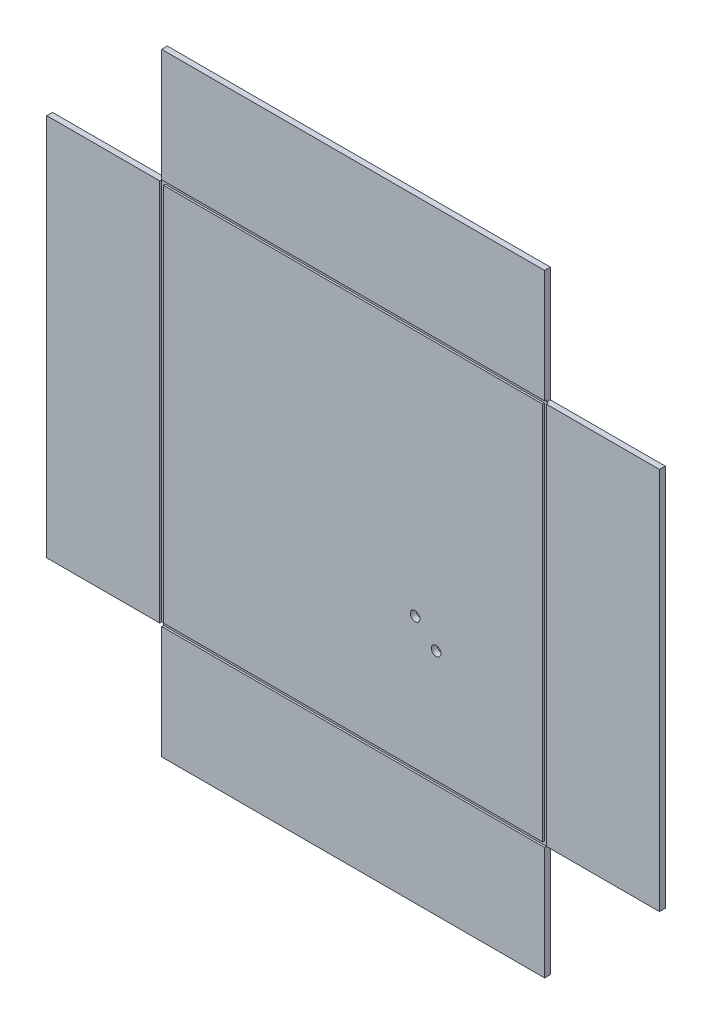
ISO-10303-21;
HEADER;
FILE_DESCRIPTION(('STEP AP214'),'2;1');
FILE_NAME('part.step','',(''),(''),'','','');
FILE_SCHEMA(('AUTOMOTIVE_DESIGN { 1 0 10303 214 1 1 1 1 }'));
ENDSEC;
DATA;
#1=APPLICATION_CONTEXT('core data for automotive mechanical design processes');
#2=APPLICATION_PROTOCOL_DEFINITION('international standard','automotive_design',2000,#1);
#3=PRODUCT_CONTEXT('',#1,'mechanical');
#4=PRODUCT('Part','Part','',(#3));
#5=PRODUCT_RELATED_PRODUCT_CATEGORY('part','',(#4));
#6=PRODUCT_DEFINITION_FORMATION('','',#4);
#7=PRODUCT_DEFINITION_CONTEXT('part definition',#1,'design');
#8=PRODUCT_DEFINITION('design','',#6,#7);
#9=PRODUCT_DEFINITION_SHAPE('','',#8);
#10=(LENGTH_UNIT() NAMED_UNIT(*) SI_UNIT(.MILLI.,.METRE.));
#11=(NAMED_UNIT(*) PLANE_ANGLE_UNIT() SI_UNIT($,.RADIAN.));
#12=(NAMED_UNIT(*) SI_UNIT($,.STERADIAN.) SOLID_ANGLE_UNIT());
#13=UNCERTAINTY_MEASURE_WITH_UNIT(LENGTH_MEASURE(1.E-05),#10,'distance_accuracy_value','');
#14=(GEOMETRIC_REPRESENTATION_CONTEXT(3) GLOBAL_UNCERTAINTY_ASSIGNED_CONTEXT((#13)) GLOBAL_UNIT_ASSIGNED_CONTEXT((#10,
#11,#12)) REPRESENTATION_CONTEXT('',''));
#15=CARTESIAN_POINT('',(0.,0.,0.));
#16=DIRECTION('',(0.,0.,1.));
#17=DIRECTION('',(1.,0.,0.));
#18=AXIS2_PLACEMENT_3D('',#15,#16,#17);
#19=CARTESIAN_POINT('',(0.,0.,3.));
#20=DIRECTION('',(0.,0.,1.));
#21=DIRECTION('',(1.,0.,0.));
#22=AXIS2_PLACEMENT_3D('',#19,#20,#21);
#23=PLANE('',#22);
#24=DIRECTION('',(0.,-1.,0.));
#25=VECTOR('',#24,1.);
#26=CARTESIAN_POINT('',(-101.000000000001,101.,3.));
#27=LINE('',#26,#25);
#28=CARTESIAN_POINT('',(-101.000000000001,100.,3.));
#29=VERTEX_POINT('',#28);
#30=CARTESIAN_POINT('',(-101.000000000001,-100.,3.));
#31=VERTEX_POINT('',#30);
#32=EDGE_CURVE('E235',#29,#31,#27,.T.);
#33=ORIENTED_EDGE('',*,*,#32,.F.);
#34=DIRECTION('',(1.,0.,0.));
#35=VECTOR('',#34,1.);
#36=CARTESIAN_POINT('',(-160.000000000001,100.,3.));
#37=LINE('',#36,#35);
#38=CARTESIAN_POINT('',(-160.000000000001,100.,3.));
#39=VERTEX_POINT('',#38);
#40=EDGE_CURVE('E321',#39,#29,#37,.T.);
#41=ORIENTED_EDGE('',*,*,#40,.F.);
#42=DIRECTION('',(0.,-1.,0.));
#43=VECTOR('',#42,1.);
#44=CARTESIAN_POINT('',(-160.,160.,3.));
#45=LINE('',#44,#43);
#46=CARTESIAN_POINT('',(-160.,-100.,3.));
#47=VERTEX_POINT('',#46);
#48=EDGE_CURVE('E352',#39,#47,#45,.T.);
#49=ORIENTED_EDGE('',*,*,#48,.T.);
#50=DIRECTION('',(-1.,0.,0.));
#51=VECTOR('',#50,1.);
#52=CARTESIAN_POINT('',(-160.,-100.,3.));
#53=LINE('',#52,#51);
#54=EDGE_CURVE('E341',#31,#47,#53,.T.);
#55=ORIENTED_EDGE('',*,*,#54,.F.);
#56=EDGE_LOOP('',(#33,#41,#49,#55));
#57=FACE_BOUND('',#56,.T.);
#58=ADVANCED_FACE('F33',(#57),#23,.T.);
#59=DIRECTION('',(-1.,0.,0.));
#60=VECTOR('',#59,1.);
#61=CARTESIAN_POINT('',(-101.000000000001,101.,3.));
#62=LINE('',#61,#60);
#63=CARTESIAN_POINT('',(99.9999999999991,101.,3.));
#64=VERTEX_POINT('',#63);
#65=CARTESIAN_POINT('',(-100.000000000001,101.,3.));
#66=VERTEX_POINT('',#65);
#67=EDGE_CURVE('E243',#64,#66,#62,.T.);
#68=ORIENTED_EDGE('',*,*,#67,.F.);
#69=DIRECTION('',(0.,-1.,0.));
#70=VECTOR('',#69,1.);
#71=CARTESIAN_POINT('',(99.9999999999991,100.,3.));
#72=LINE('',#71,#70);
#73=CARTESIAN_POINT('',(99.9999999999991,160.,3.));
#74=VERTEX_POINT('',#73);
#75=EDGE_CURVE('E304',#74,#64,#72,.T.);
#76=ORIENTED_EDGE('',*,*,#75,.F.);
#77=DIRECTION('',(-1.,0.,0.));
#78=VECTOR('',#77,1.);
#79=CARTESIAN_POINT('',(-160.,160.,3.));
#80=LINE('',#79,#78);
#81=CARTESIAN_POINT('',(-100.000000000001,160.,3.));
#82=VERTEX_POINT('',#81);
#83=EDGE_CURVE('E362',#74,#82,#80,.T.);
#84=ORIENTED_EDGE('',*,*,#83,.T.);
#85=DIRECTION('',(0.,1.,0.));
#86=VECTOR('',#85,1.);
#87=CARTESIAN_POINT('',(-100.000000000001,100.,3.));
#88=LINE('',#87,#86);
#89=EDGE_CURVE('E324',#66,#82,#88,.T.);
#90=ORIENTED_EDGE('',*,*,#89,.F.);
#91=EDGE_LOOP('',(#68,#76,#84,#90));
#92=FACE_BOUND('',#91,.T.);
#93=ADVANCED_FACE('F392',(#92),#23,.T.);
#94=DIRECTION('',(0.,1.,0.));
#95=VECTOR('',#94,1.);
#96=CARTESIAN_POINT('',(101.,101.,3.));
#97=LINE('',#96,#95);
#98=CARTESIAN_POINT('',(101.,-100.,3.));
#99=VERTEX_POINT('',#98);
#100=CARTESIAN_POINT('',(101.,100.,3.));
#101=VERTEX_POINT('',#100);
#102=EDGE_CURVE('E254',#99,#101,#97,.T.);
#103=ORIENTED_EDGE('',*,*,#102,.F.);
#104=DIRECTION('',(-1.,0.,0.));
#105=VECTOR('',#104,1.);
#106=CARTESIAN_POINT('',(100.,-100.,3.));
#107=LINE('',#106,#105);
#108=CARTESIAN_POINT('',(160.,-100.,3.));
#109=VERTEX_POINT('',#108);
#110=EDGE_CURVE('E290',#109,#99,#107,.T.);
#111=ORIENTED_EDGE('',*,*,#110,.F.);
#112=DIRECTION('',(0.,1.,0.));
#113=VECTOR('',#112,1.);
#114=CARTESIAN_POINT('',(160.,160.,3.));
#115=LINE('',#114,#113);
#116=CARTESIAN_POINT('',(159.999999999999,100.,3.));
#117=VERTEX_POINT('',#116);
#118=EDGE_CURVE('E359',#109,#117,#115,.T.);
#119=ORIENTED_EDGE('',*,*,#118,.T.);
#120=DIRECTION('',(1.,0.,0.));
#121=VECTOR('',#120,1.);
#122=CARTESIAN_POINT('',(99.9999999999991,100.,3.));
#123=LINE('',#122,#121);
#124=EDGE_CURVE('E308',#101,#117,#123,.T.);
#125=ORIENTED_EDGE('',*,*,#124,.F.);
#126=EDGE_LOOP('',(#103,#111,#119,#125));
#127=FACE_BOUND('',#126,.T.);
#128=ADVANCED_FACE('F460',(#127),#23,.T.);
#129=CARTESIAN_POINT('',(-160.,160.,3.));
#130=DIRECTION('',(1.,0.,0.));
#131=DIRECTION('',(0.,0.,-1.));
#132=AXIS2_PLACEMENT_3D('',#129,#130,#131);
#133=PLANE('',#132);
#134=ORIENTED_EDGE('',*,*,#48,.F.);
#135=DIRECTION('',(0.,0.,1.));
#136=VECTOR('',#135,1.);
#137=CARTESIAN_POINT('',(-160.000000000001,100.,-0.00100000000000013));
#138=LINE('',#137,#136);
#139=CARTESIAN_POINT('',(-160.,100.,0.));
#140=VERTEX_POINT('',#139);
#141=EDGE_CURVE('E326',#140,#39,#138,.T.);
#142=ORIENTED_EDGE('',*,*,#141,.F.);
#143=DIRECTION('',(0.,-1.,0.));
#144=VECTOR('',#143,1.);
#145=CARTESIAN_POINT('',(-160.,160.,0.));
#146=LINE('',#145,#144);
#147=CARTESIAN_POINT('',(-160.,-100.,0.));
#148=VERTEX_POINT('',#147);
#149=EDGE_CURVE('E347',#140,#148,#146,.T.);
#150=ORIENTED_EDGE('',*,*,#149,.T.);
#151=DIRECTION('',(0.,0.,1.));
#152=VECTOR('',#151,1.);
#153=CARTESIAN_POINT('',(-160.,-100.,-0.00100000000000013));
#154=LINE('',#153,#152);
#155=EDGE_CURVE('E344',#148,#47,#154,.T.);
#156=ORIENTED_EDGE('',*,*,#155,.T.);
#157=EDGE_LOOP('',(#134,#142,#150,#156));
#158=FACE_BOUND('',#157,.T.);
#159=ADVANCED_FACE('F35',(#158),#133,.F.);
#160=CARTESIAN_POINT('',(-160.,-160.,3.));
#161=DIRECTION('',(0.,1.,0.));
#162=DIRECTION('',(-1.,0.,0.));
#163=AXIS2_PLACEMENT_3D('',#160,#161,#162);
#164=PLANE('',#163);
#165=DIRECTION('',(1.,0.,0.));
#166=VECTOR('',#165,1.);
#167=CARTESIAN_POINT('',(-160.,-160.,0.));
#168=LINE('',#167,#166);
#169=CARTESIAN_POINT('',(-100.,-160.,0.));
#170=VERTEX_POINT('',#169);
#171=CARTESIAN_POINT('',(100.,-160.,0.));
#172=VERTEX_POINT('',#171);
#173=EDGE_CURVE('E367',#170,#172,#168,.T.);
#174=ORIENTED_EDGE('',*,*,#173,.T.);
#175=DIRECTION('',(0.,0.,1.));
#176=VECTOR('',#175,1.);
#177=CARTESIAN_POINT('',(100.,-160.,-0.00100000000000013));
#178=LINE('',#177,#176);
#179=CARTESIAN_POINT('',(100.,-160.,3.));
#180=VERTEX_POINT('',#179);
#181=EDGE_CURVE('E293',#172,#180,#178,.T.);
#182=ORIENTED_EDGE('',*,*,#181,.T.);
#183=DIRECTION('',(1.,0.,0.));
#184=VECTOR('',#183,1.);
#185=CARTESIAN_POINT('',(-160.,-160.,3.));
#186=LINE('',#185,#184);
#187=CARTESIAN_POINT('',(-100.,-160.,3.));
#188=VERTEX_POINT('',#187);
#189=EDGE_CURVE('E355',#188,#180,#186,.T.);
#190=ORIENTED_EDGE('',*,*,#189,.F.);
#191=DIRECTION('',(0.,0.,1.));
#192=VECTOR('',#191,1.);
#193=CARTESIAN_POINT('',(-100.,-160.,-0.00100000000000013));
#194=LINE('',#193,#192);
#195=EDGE_CURVE('E343',#170,#188,#194,.T.);
#196=ORIENTED_EDGE('',*,*,#195,.F.);
#197=EDGE_LOOP('',(#174,#182,#190,#196));
#198=FACE_BOUND('',#197,.T.);
#199=ADVANCED_FACE('F439',(#198),#164,.F.);
#200=CARTESIAN_POINT('',(160.,160.,3.));
#201=DIRECTION('',(-1.,0.,0.));
#202=DIRECTION('',(0.,-1.,0.));
#203=AXIS2_PLACEMENT_3D('',#200,#201,#202);
#204=PLANE('',#203);
#205=ORIENTED_EDGE('',*,*,#118,.F.);
#206=DIRECTION('',(0.,0.,1.));
#207=VECTOR('',#206,1.);
#208=CARTESIAN_POINT('',(160.,-100.,-0.00100000000000013));
#209=LINE('',#208,#207);
#210=CARTESIAN_POINT('',(160.,-100.,0.));
#211=VERTEX_POINT('',#210);
#212=EDGE_CURVE('E298',#211,#109,#209,.T.);
#213=ORIENTED_EDGE('',*,*,#212,.F.);
#214=DIRECTION('',(0.,1.,0.));
#215=VECTOR('',#214,1.);
#216=CARTESIAN_POINT('',(160.,160.,0.));
#217=LINE('',#216,#215);
#218=CARTESIAN_POINT('',(160.,100.,0.));
#219=VERTEX_POINT('',#218);
#220=EDGE_CURVE('E370',#211,#219,#217,.T.);
#221=ORIENTED_EDGE('',*,*,#220,.T.);
#222=DIRECTION('',(0.,0.,1.));
#223=VECTOR('',#222,1.);
#224=CARTESIAN_POINT('',(159.999999999999,100.,-0.00100000000000013));
#225=LINE('',#224,#223);
#226=EDGE_CURVE('E313',#219,#117,#225,.T.);
#227=ORIENTED_EDGE('',*,*,#226,.T.);
#228=EDGE_LOOP('',(#205,#213,#221,#227));
#229=FACE_BOUND('',#228,.T.);
#230=ADVANCED_FACE('F456',(#229),#204,.F.);
#231=CARTESIAN_POINT('',(-160.,160.,3.));
#232=DIRECTION('',(0.,-1.,0.));
#233=DIRECTION('',(0.,0.,-1.));
#234=AXIS2_PLACEMENT_3D('',#231,#232,#233);
#235=PLANE('',#234);
#236=ORIENTED_EDGE('',*,*,#83,.F.);
#237=DIRECTION('',(0.,0.,1.));
#238=VECTOR('',#237,1.);
#239=CARTESIAN_POINT('',(99.9999999999991,160.,-0.00100000000000013));
#240=LINE('',#239,#238);
#241=CARTESIAN_POINT('',(99.9999999999991,160.,0.));
#242=VERTEX_POINT('',#241);
#243=EDGE_CURVE('E311',#242,#74,#240,.T.);
#244=ORIENTED_EDGE('',*,*,#243,.F.);
#245=DIRECTION('',(-1.,0.,0.));
#246=VECTOR('',#245,1.);
#247=CARTESIAN_POINT('',(-160.,160.,0.));
#248=LINE('',#247,#246);
#249=CARTESIAN_POINT('',(-100.000000000001,160.,0.));
#250=VERTEX_POINT('',#249);
#251=EDGE_CURVE('E356',#242,#250,#248,.T.);
#252=ORIENTED_EDGE('',*,*,#251,.T.);
#253=DIRECTION('',(0.,0.,1.));
#254=VECTOR('',#253,1.);
#255=CARTESIAN_POINT('',(-100.000000000001,160.,-0.00100000000000013));
#256=LINE('',#255,#254);
#257=EDGE_CURVE('E327',#250,#82,#256,.T.);
#258=ORIENTED_EDGE('',*,*,#257,.T.);
#259=EDGE_LOOP('',(#236,#244,#252,#258));
#260=FACE_BOUND('',#259,.T.);
#261=ADVANCED_FACE('F399',(#260),#235,.F.);
#262=DIRECTION('',(1.,0.,0.));
#263=VECTOR('',#262,1.);
#264=CARTESIAN_POINT('',(-101.000000000001,-101.,3.));
#265=LINE('',#264,#263);
#266=CARTESIAN_POINT('',(-100.,-101.,3.));
#267=VERTEX_POINT('',#266);
#268=CARTESIAN_POINT('',(100.,-101.,3.));
#269=VERTEX_POINT('',#268);
#270=EDGE_CURVE('E252',#267,#269,#265,.T.);
#271=ORIENTED_EDGE('',*,*,#270,.F.);
#272=DIRECTION('',(0.,1.,0.));
#273=VECTOR('',#272,1.);
#274=CARTESIAN_POINT('',(-100.,-160.,3.));
#275=LINE('',#274,#273);
#276=EDGE_CURVE('E338',#188,#267,#275,.T.);
#277=ORIENTED_EDGE('',*,*,#276,.F.);
#278=ORIENTED_EDGE('',*,*,#189,.T.);
#279=DIRECTION('',(0.,-1.,0.));
#280=VECTOR('',#279,1.);
#281=CARTESIAN_POINT('',(100.,-160.,3.));
#282=LINE('',#281,#280);
#283=EDGE_CURVE('E288',#269,#180,#282,.T.);
#284=ORIENTED_EDGE('',*,*,#283,.F.);
#285=EDGE_LOOP('',(#271,#277,#278,#284));
#286=FACE_BOUND('',#285,.T.);
#287=ADVANCED_FACE('F443',(#286),#23,.T.);
#288=CARTESIAN_POINT('',(0.,0.,0.));
#289=DIRECTION('',(0.,0.,1.));
#290=DIRECTION('',(1.,0.,0.));
#291=AXIS2_PLACEMENT_3D('',#288,#289,#290);
#292=PLANE('',#291);
#293=CARTESIAN_POINT('',(32.3499682837209,-30.1668334606443,0.));
#294=DIRECTION('',(0.,0.,1.));
#295=DIRECTION('',(1.,0.,0.));
#296=AXIS2_PLACEMENT_3D('',#293,#294,#295);
#297=CIRCLE('',#296,2.5);
#298=CARTESIAN_POINT('',(34.8499682837209,-30.1668334606443,0.));
#299=VERTEX_POINT('',#298);
#300=EDGE_CURVE('E699',#299,#299,#297,.T.);
#301=ORIENTED_EDGE('',*,*,#300,.T.);
#302=EDGE_LOOP('',(#301));
#303=FACE_BOUND('',#302,.T.);
#304=CARTESIAN_POINT('',(43.3202738080086,-40.3968088615817,0.));
#305=DIRECTION('',(0.,0.,1.));
#306=DIRECTION('',(1.,0.,0.));
#307=AXIS2_PLACEMENT_3D('',#304,#305,#306);
#308=CIRCLE('',#307,2.5);
#309=CARTESIAN_POINT('',(45.8202738080085,-40.3968088615817,0.));
#310=VERTEX_POINT('',#309);
#311=EDGE_CURVE('E225',#310,#310,#308,.T.);
#312=ORIENTED_EDGE('',*,*,#311,.T.);
#313=EDGE_LOOP('',(#312));
#314=FACE_BOUND('',#313,.T.);
#315=DIRECTION('',(1.,0.,0.));
#316=VECTOR('',#315,1.);
#317=CARTESIAN_POINT('',(100.,-100.,0.));
#318=LINE('',#317,#316);
#319=CARTESIAN_POINT('',(100.,-100.,0.));
#320=VERTEX_POINT('',#319);
#321=EDGE_CURVE('E283',#320,#211,#318,.T.);
#322=ORIENTED_EDGE('',*,*,#321,.F.);
#323=DIRECTION('',(0.,1.,0.));
#324=VECTOR('',#323,1.);
#325=CARTESIAN_POINT('',(100.,-160.,0.));
#326=LINE('',#325,#324);
#327=EDGE_CURVE('E285',#172,#320,#326,.T.);
#328=ORIENTED_EDGE('',*,*,#327,.F.);
#329=ORIENTED_EDGE('',*,*,#173,.F.);
#330=DIRECTION('',(0.,-1.,0.));
#331=VECTOR('',#330,1.);
#332=CARTESIAN_POINT('',(-100.,-160.,0.));
#333=LINE('',#332,#331);
#334=CARTESIAN_POINT('',(-100.,-100.,0.));
#335=VERTEX_POINT('',#334);
#336=EDGE_CURVE('E297',#335,#170,#333,.T.);
#337=ORIENTED_EDGE('',*,*,#336,.F.);
#338=DIRECTION('',(1.,0.,0.));
#339=VECTOR('',#338,1.);
#340=CARTESIAN_POINT('',(-160.,-100.,0.));
#341=LINE('',#340,#339);
#342=EDGE_CURVE('E336',#148,#335,#341,.T.);
#343=ORIENTED_EDGE('',*,*,#342,.F.);
#344=ORIENTED_EDGE('',*,*,#149,.F.);
#345=DIRECTION('',(-1.,0.,0.));
#346=VECTOR('',#345,1.);
#347=CARTESIAN_POINT('',(-160.000000000001,100.,0.));
#348=LINE('',#347,#346);
#349=CARTESIAN_POINT('',(-100.000000000001,100.,0.));
#350=VERTEX_POINT('',#349);
#351=EDGE_CURVE('E305',#350,#140,#348,.T.);
#352=ORIENTED_EDGE('',*,*,#351,.F.);
#353=DIRECTION('',(0.,-1.,0.));
#354=VECTOR('',#353,1.);
#355=CARTESIAN_POINT('',(-100.000000000001,100.,0.));
#356=LINE('',#355,#354);
#357=EDGE_CURVE('E282',#250,#350,#356,.T.);
#358=ORIENTED_EDGE('',*,*,#357,.F.);
#359=ORIENTED_EDGE('',*,*,#251,.F.);
#360=DIRECTION('',(0.,1.,0.));
#361=VECTOR('',#360,1.);
#362=CARTESIAN_POINT('',(99.9999999999991,100.,0.));
#363=LINE('',#362,#361);
#364=CARTESIAN_POINT('',(99.9999999999991,100.,0.));
#365=VERTEX_POINT('',#364);
#366=EDGE_CURVE('E302',#365,#242,#363,.T.);
#367=ORIENTED_EDGE('',*,*,#366,.F.);
#368=DIRECTION('',(-1.,0.,0.));
#369=VECTOR('',#368,1.);
#370=CARTESIAN_POINT('',(99.9999999999991,100.,0.));
#371=LINE('',#370,#369);
#372=EDGE_CURVE('E286',#219,#365,#371,.T.);
#373=ORIENTED_EDGE('',*,*,#372,.F.);
#374=ORIENTED_EDGE('',*,*,#220,.F.);
#375=EDGE_LOOP('',(#322,#328,#329,#337,#343,#344,#352,#358,#359,#367,#373,#374));
#376=FACE_BOUND('',#375,.T.);
#377=ADVANCED_FACE('F405',(#303,#314,#376),#292,.F.);
#378=CARTESIAN_POINT('',(-160.,-100.,-0.00100000000000013));
#379=DIRECTION('',(0.,1.,0.));
#380=DIRECTION('',(0.,0.,1.));
#381=AXIS2_PLACEMENT_3D('',#378,#379,#380);
#382=PLANE('',#381);
#383=DIRECTION('',(1.,0.,0.));
#384=VECTOR('',#383,1.);
#385=CARTESIAN_POINT('',(-160.,-100.,2.));
#386=LINE('',#385,#384);
#387=CARTESIAN_POINT('',(-101.000000000001,-100.,2.));
#388=VERTEX_POINT('',#387);
#389=CARTESIAN_POINT('',(-100.,-100.,2.));
#390=VERTEX_POINT('',#389);
#391=EDGE_CURVE('E268',#388,#390,#386,.T.);
#392=ORIENTED_EDGE('',*,*,#391,.F.);
#393=DIRECTION('',(0.,0.,1.));
#394=VECTOR('',#393,1.);
#395=CARTESIAN_POINT('',(-101.000000000001,-100.,-0.00100000000000013));
#396=LINE('',#395,#394);
#397=EDGE_CURVE('E279',#388,#31,#396,.T.);
#398=ORIENTED_EDGE('',*,*,#397,.T.);
#399=ORIENTED_EDGE('',*,*,#54,.T.);
#400=ORIENTED_EDGE('',*,*,#155,.F.);
#401=ORIENTED_EDGE('',*,*,#342,.T.);
#402=DIRECTION('',(0.,0.,1.));
#403=VECTOR('',#402,1.);
#404=CARTESIAN_POINT('',(-100.,-100.,-0.00100000000000013));
#405=LINE('',#404,#403);
#406=EDGE_CURVE('E348',#335,#390,#405,.T.);
#407=ORIENTED_EDGE('',*,*,#406,.T.);
#408=EDGE_LOOP('',(#392,#398,#399,#400,#401,#407));
#409=FACE_BOUND('',#408,.T.);
#410=ADVANCED_FACE('F421',(#409),#382,.F.);
#411=CARTESIAN_POINT('',(-100.,-160.,-0.00100000000000013));
#412=DIRECTION('',(1.,0.,0.));
#413=DIRECTION('',(0.,0.,-1.));
#414=AXIS2_PLACEMENT_3D('',#411,#412,#413);
#415=PLANE('',#414);
#416=ORIENTED_EDGE('',*,*,#276,.T.);
#417=DIRECTION('',(0.,0.,-1.));
#418=VECTOR('',#417,1.);
#419=CARTESIAN_POINT('',(-100.,-101.,-0.00100000000000013));
#420=LINE('',#419,#418);
#421=CARTESIAN_POINT('',(-100.,-101.,2.));
#422=VERTEX_POINT('',#421);
#423=EDGE_CURVE('E273',#267,#422,#420,.T.);
#424=ORIENTED_EDGE('',*,*,#423,.T.);
#425=DIRECTION('',(0.,-1.,0.));
#426=VECTOR('',#425,1.);
#427=CARTESIAN_POINT('',(-100.,-160.,2.));
#428=LINE('',#427,#426);
#429=EDGE_CURVE('E266',#390,#422,#428,.T.);
#430=ORIENTED_EDGE('',*,*,#429,.F.);
#431=ORIENTED_EDGE('',*,*,#406,.F.);
#432=ORIENTED_EDGE('',*,*,#336,.T.);
#433=ORIENTED_EDGE('',*,*,#195,.T.);
#434=EDGE_LOOP('',(#416,#424,#430,#431,#432,#433));
#435=FACE_BOUND('',#434,.T.);
#436=ADVANCED_FACE('F434',(#435),#415,.F.);
#437=CARTESIAN_POINT('',(-100.000000000001,100.,-0.00100000000000013));
#438=DIRECTION('',(1.,0.,0.));
#439=DIRECTION('',(0.,0.,-1.));
#440=AXIS2_PLACEMENT_3D('',#437,#438,#439);
#441=PLANE('',#440);
#442=DIRECTION('',(0.,-1.,0.));
#443=VECTOR('',#442,1.);
#444=CARTESIAN_POINT('',(-100.000000000001,100.,2.));
#445=LINE('',#444,#443);
#446=CARTESIAN_POINT('',(-100.000000000001,101.,2.));
#447=VERTEX_POINT('',#446);
#448=CARTESIAN_POINT('',(-100.000000000001,100.,2.));
#449=VERTEX_POINT('',#448);
#450=EDGE_CURVE('E264',#447,#449,#445,.T.);
#451=ORIENTED_EDGE('',*,*,#450,.F.);
#452=DIRECTION('',(0.,0.,1.));
#453=VECTOR('',#452,1.);
#454=CARTESIAN_POINT('',(-100.000000000001,101.,-0.00100000000000013));
#455=LINE('',#454,#453);
#456=EDGE_CURVE('E276',#447,#66,#455,.T.);
#457=ORIENTED_EDGE('',*,*,#456,.T.);
#458=ORIENTED_EDGE('',*,*,#89,.T.);
#459=ORIENTED_EDGE('',*,*,#257,.F.);
#460=ORIENTED_EDGE('',*,*,#357,.T.);
#461=DIRECTION('',(0.,0.,1.));
#462=VECTOR('',#461,1.);
#463=CARTESIAN_POINT('',(-100.000000000001,100.,-0.00100000000000013));
#464=LINE('',#463,#462);
#465=EDGE_CURVE('E330',#350,#449,#464,.T.);
#466=ORIENTED_EDGE('',*,*,#465,.T.);
#467=EDGE_LOOP('',(#451,#457,#458,#459,#460,#466));
#468=FACE_BOUND('',#467,.T.);
#469=ADVANCED_FACE('F396',(#468),#441,.F.);
#470=CARTESIAN_POINT('',(-160.000000000001,100.,-0.00100000000000013));
#471=DIRECTION('',(0.,-1.,0.));
#472=DIRECTION('',(0.,0.,-1.));
#473=AXIS2_PLACEMENT_3D('',#470,#471,#472);
#474=PLANE('',#473);
#475=ORIENTED_EDGE('',*,*,#40,.T.);
#476=DIRECTION('',(0.,0.,-1.));
#477=VECTOR('',#476,1.);
#478=CARTESIAN_POINT('',(-101.000000000001,100.,-0.00100000000000013));
#479=LINE('',#478,#477);
#480=CARTESIAN_POINT('',(-101.000000000001,100.,2.));
#481=VERTEX_POINT('',#480);
#482=EDGE_CURVE('E11',#29,#481,#479,.T.);
#483=ORIENTED_EDGE('',*,*,#482,.T.);
#484=DIRECTION('',(-1.,0.,0.));
#485=VECTOR('',#484,1.);
#486=CARTESIAN_POINT('',(-160.000000000001,100.,2.));
#487=LINE('',#486,#485);
#488=EDGE_CURVE('E262',#449,#481,#487,.T.);
#489=ORIENTED_EDGE('',*,*,#488,.F.);
#490=ORIENTED_EDGE('',*,*,#465,.F.);
#491=ORIENTED_EDGE('',*,*,#351,.T.);
#492=ORIENTED_EDGE('',*,*,#141,.T.);
#493=EDGE_LOOP('',(#475,#483,#489,#490,#491,#492));
#494=FACE_BOUND('',#493,.T.);
#495=ADVANCED_FACE('F412',(#494),#474,.F.);
#496=CARTESIAN_POINT('',(99.9999999999991,100.,-0.00100000000000013));
#497=DIRECTION('',(-1.,0.,0.));
#498=DIRECTION('',(0.,0.,1.));
#499=AXIS2_PLACEMENT_3D('',#496,#497,#498);
#500=PLANE('',#499);
#501=ORIENTED_EDGE('',*,*,#75,.T.);
#502=DIRECTION('',(0.,0.,-1.));
#503=VECTOR('',#502,1.);
#504=CARTESIAN_POINT('',(99.9999999999991,101.,-0.00100000000000013));
#505=LINE('',#504,#503);
#506=CARTESIAN_POINT('',(99.9999999999991,101.,2.));
#507=VERTEX_POINT('',#506);
#508=EDGE_CURVE('E41',#64,#507,#505,.T.);
#509=ORIENTED_EDGE('',*,*,#508,.T.);
#510=DIRECTION('',(0.,1.,0.));
#511=VECTOR('',#510,1.);
#512=CARTESIAN_POINT('',(99.9999999999991,100.,2.));
#513=LINE('',#512,#511);
#514=CARTESIAN_POINT('',(99.9999999999991,100.,2.));
#515=VERTEX_POINT('',#514);
#516=EDGE_CURVE('E260',#515,#507,#513,.T.);
#517=ORIENTED_EDGE('',*,*,#516,.F.);
#518=DIRECTION('',(0.,0.,1.));
#519=VECTOR('',#518,1.);
#520=CARTESIAN_POINT('',(99.9999999999991,100.,-0.00100000000000013));
#521=LINE('',#520,#519);
#522=EDGE_CURVE('E310',#365,#515,#521,.T.);
#523=ORIENTED_EDGE('',*,*,#522,.F.);
#524=ORIENTED_EDGE('',*,*,#366,.T.);
#525=ORIENTED_EDGE('',*,*,#243,.T.);
#526=EDGE_LOOP('',(#501,#509,#517,#523,#524,#525));
#527=FACE_BOUND('',#526,.T.);
#528=ADVANCED_FACE('F384',(#527),#500,.F.);
#529=CARTESIAN_POINT('',(99.9999999999991,100.,-0.00100000000000013));
#530=DIRECTION('',(0.,-1.,0.));
#531=DIRECTION('',(0.,0.,-1.));
#532=AXIS2_PLACEMENT_3D('',#529,#530,#531);
#533=PLANE('',#532);
#534=DIRECTION('',(-1.,0.,0.));
#535=VECTOR('',#534,1.);
#536=CARTESIAN_POINT('',(99.9999999999991,100.,2.));
#537=LINE('',#536,#535);
#538=CARTESIAN_POINT('',(101.,100.,2.));
#539=VERTEX_POINT('',#538);
#540=EDGE_CURVE('E258',#539,#515,#537,.T.);
#541=ORIENTED_EDGE('',*,*,#540,.F.);
#542=DIRECTION('',(0.,0.,1.));
#543=VECTOR('',#542,1.);
#544=CARTESIAN_POINT('',(101.,100.,-0.00100000000000013));
#545=LINE('',#544,#543);
#546=EDGE_CURVE('E270',#539,#101,#545,.T.);
#547=ORIENTED_EDGE('',*,*,#546,.T.);
#548=ORIENTED_EDGE('',*,*,#124,.T.);
#549=ORIENTED_EDGE('',*,*,#226,.F.);
#550=ORIENTED_EDGE('',*,*,#372,.T.);
#551=ORIENTED_EDGE('',*,*,#522,.T.);
#552=EDGE_LOOP('',(#541,#547,#548,#549,#550,#551));
#553=FACE_BOUND('',#552,.T.);
#554=ADVANCED_FACE('F467',(#553),#533,.F.);
#555=CARTESIAN_POINT('',(100.,-160.,-0.00100000000000013));
#556=DIRECTION('',(-1.,0.,0.));
#557=DIRECTION('',(0.,0.,1.));
#558=AXIS2_PLACEMENT_3D('',#555,#556,#557);
#559=PLANE('',#558);
#560=DIRECTION('',(0.,1.,0.));
#561=VECTOR('',#560,1.);
#562=CARTESIAN_POINT('',(100.,-160.,2.));
#563=LINE('',#562,#561);
#564=CARTESIAN_POINT('',(100.,-101.,2.));
#565=VERTEX_POINT('',#564);
#566=CARTESIAN_POINT('',(100.,-100.,2.));
#567=VERTEX_POINT('',#566);
#568=EDGE_CURVE('E56',#565,#567,#563,.T.);
#569=ORIENTED_EDGE('',*,*,#568,.F.);
#570=DIRECTION('',(0.,0.,1.));
#571=VECTOR('',#570,1.);
#572=CARTESIAN_POINT('',(100.,-101.,-0.00100000000000013));
#573=LINE('',#572,#571);
#574=EDGE_CURVE('E379',#565,#269,#573,.T.);
#575=ORIENTED_EDGE('',*,*,#574,.T.);
#576=ORIENTED_EDGE('',*,*,#283,.T.);
#577=ORIENTED_EDGE('',*,*,#181,.F.);
#578=ORIENTED_EDGE('',*,*,#327,.T.);
#579=DIRECTION('',(0.,0.,1.));
#580=VECTOR('',#579,1.);
#581=CARTESIAN_POINT('',(100.,-100.,-0.00100000000000013));
#582=LINE('',#581,#580);
#583=EDGE_CURVE('E294',#320,#567,#582,.T.);
#584=ORIENTED_EDGE('',*,*,#583,.T.);
#585=EDGE_LOOP('',(#569,#575,#576,#577,#578,#584));
#586=FACE_BOUND('',#585,.T.);
#587=ADVANCED_FACE('F448',(#586),#559,.F.);
#588=CARTESIAN_POINT('',(100.,-100.,-0.00100000000000013));
#589=DIRECTION('',(0.,1.,0.));
#590=DIRECTION('',(0.,0.,1.));
#591=AXIS2_PLACEMENT_3D('',#588,#589,#590);
#592=PLANE('',#591);
#593=ORIENTED_EDGE('',*,*,#110,.T.);
#594=DIRECTION('',(0.,0.,-1.));
#595=VECTOR('',#594,1.);
#596=CARTESIAN_POINT('',(101.,-100.,-0.00100000000000013));
#597=LINE('',#596,#595);
#598=CARTESIAN_POINT('',(101.,-100.,2.));
#599=VERTEX_POINT('',#598);
#600=EDGE_CURVE('E376',#99,#599,#597,.T.);
#601=ORIENTED_EDGE('',*,*,#600,.T.);
#602=DIRECTION('',(1.,0.,0.));
#603=VECTOR('',#602,1.);
#604=CARTESIAN_POINT('',(100.,-100.,2.));
#605=LINE('',#604,#603);
#606=EDGE_CURVE('E365',#567,#599,#605,.T.);
#607=ORIENTED_EDGE('',*,*,#606,.F.);
#608=ORIENTED_EDGE('',*,*,#583,.F.);
#609=ORIENTED_EDGE('',*,*,#321,.T.);
#610=ORIENTED_EDGE('',*,*,#212,.T.);
#611=EDGE_LOOP('',(#593,#601,#607,#608,#609,#610));
#612=FACE_BOUND('',#611,.T.);
#613=ADVANCED_FACE('F451',(#612),#592,.F.);
#614=CARTESIAN_POINT('',(-101.000000000001,101.,2.));
#615=DIRECTION('',(-1.,0.,0.));
#616=DIRECTION('',(0.,0.,1.));
#617=AXIS2_PLACEMENT_3D('',#614,#615,#616);
#618=PLANE('',#617);
#619=DIRECTION('',(0.,-1.,0.));
#620=VECTOR('',#619,1.);
#621=CARTESIAN_POINT('',(-101.000000000001,101.,2.));
#622=LINE('',#621,#620);
#623=EDGE_CURVE('E239',#481,#388,#622,.T.);
#624=ORIENTED_EDGE('',*,*,#623,.F.);
#625=ORIENTED_EDGE('',*,*,#482,.F.);
#626=ORIENTED_EDGE('',*,*,#32,.T.);
#627=ORIENTED_EDGE('',*,*,#397,.F.);
#628=EDGE_LOOP('',(#624,#625,#626,#627));
#629=FACE_BOUND('',#628,.T.);
#630=ADVANCED_FACE('F417',(#629),#618,.F.);
#631=CARTESIAN_POINT('',(-101.000000000001,101.,2.));
#632=DIRECTION('',(0.,1.,0.));
#633=DIRECTION('',(0.,0.,1.));
#634=AXIS2_PLACEMENT_3D('',#631,#632,#633);
#635=PLANE('',#634);
#636=DIRECTION('',(-1.,0.,0.));
#637=VECTOR('',#636,1.);
#638=CARTESIAN_POINT('',(-101.000000000001,101.,2.));
#639=LINE('',#638,#637);
#640=EDGE_CURVE('E248',#507,#447,#639,.T.);
#641=ORIENTED_EDGE('',*,*,#640,.F.);
#642=ORIENTED_EDGE('',*,*,#508,.F.);
#643=ORIENTED_EDGE('',*,*,#67,.T.);
#644=ORIENTED_EDGE('',*,*,#456,.F.);
#645=EDGE_LOOP('',(#641,#642,#643,#644));
#646=FACE_BOUND('',#645,.T.);
#647=ADVANCED_FACE('F389',(#646),#635,.F.);
#648=CARTESIAN_POINT('',(-101.000000000001,-101.,2.));
#649=DIRECTION('',(0.,-1.,0.));
#650=DIRECTION('',(0.,0.,-1.));
#651=AXIS2_PLACEMENT_3D('',#648,#649,#650);
#652=PLANE('',#651);
#653=ORIENTED_EDGE('',*,*,#270,.T.);
#654=ORIENTED_EDGE('',*,*,#574,.F.);
#655=DIRECTION('',(1.,0.,0.));
#656=VECTOR('',#655,1.);
#657=CARTESIAN_POINT('',(-101.000000000001,-101.,2.));
#658=LINE('',#657,#656);
#659=EDGE_CURVE('E242',#422,#565,#658,.T.);
#660=ORIENTED_EDGE('',*,*,#659,.F.);
#661=ORIENTED_EDGE('',*,*,#423,.F.);
#662=EDGE_LOOP('',(#653,#654,#660,#661));
#663=FACE_BOUND('',#662,.T.);
#664=ADVANCED_FACE('F446',(#663),#652,.F.);
#665=CARTESIAN_POINT('',(101.,101.,2.));
#666=DIRECTION('',(1.,0.,0.));
#667=DIRECTION('',(0.,1.,0.));
#668=AXIS2_PLACEMENT_3D('',#665,#666,#667);
#669=PLANE('',#668);
#670=DIRECTION('',(0.,1.,0.));
#671=VECTOR('',#670,1.);
#672=CARTESIAN_POINT('',(101.,101.,2.));
#673=LINE('',#672,#671);
#674=EDGE_CURVE('E245',#599,#539,#673,.T.);
#675=ORIENTED_EDGE('',*,*,#674,.F.);
#676=ORIENTED_EDGE('',*,*,#600,.F.);
#677=ORIENTED_EDGE('',*,*,#102,.T.);
#678=ORIENTED_EDGE('',*,*,#546,.F.);
#679=EDGE_LOOP('',(#675,#676,#677,#678));
#680=FACE_BOUND('',#679,.T.);
#681=ADVANCED_FACE('F464',(#680),#669,.F.);
#682=CARTESIAN_POINT('',(0.,0.,2.));
#683=DIRECTION('',(0.,0.,1.));
#684=DIRECTION('',(1.,0.,0.));
#685=AXIS2_PLACEMENT_3D('',#682,#683,#684);
#686=PLANE('',#685);
#687=DIRECTION('',(-1.,0.,0.));
#688=VECTOR('',#687,1.);
#689=CARTESIAN_POINT('',(-99.0000000000009,99.,2.));
#690=LINE('',#689,#688);
#691=CARTESIAN_POINT('',(99.,99.,2.));
#692=VERTEX_POINT('',#691);
#693=CARTESIAN_POINT('',(-99.0000000000009,99.,2.));
#694=VERTEX_POINT('',#693);
#695=EDGE_CURVE('E207',#692,#694,#690,.T.);
#696=ORIENTED_EDGE('',*,*,#695,.F.);
#697=DIRECTION('',(0.,1.,0.));
#698=VECTOR('',#697,1.);
#699=CARTESIAN_POINT('',(99.,99.,2.));
#700=LINE('',#699,#698);
#701=CARTESIAN_POINT('',(99.,-99.,2.));
#702=VERTEX_POINT('',#701);
#703=EDGE_CURVE('E216',#702,#692,#700,.T.);
#704=ORIENTED_EDGE('',*,*,#703,.F.);
#705=DIRECTION('',(1.,0.,0.));
#706=VECTOR('',#705,1.);
#707=CARTESIAN_POINT('',(-99.0000000000009,-99.,2.));
#708=LINE('',#707,#706);
#709=CARTESIAN_POINT('',(-99.0000000000009,-99.,2.));
#710=VERTEX_POINT('',#709);
#711=EDGE_CURVE('E199',#710,#702,#708,.T.);
#712=ORIENTED_EDGE('',*,*,#711,.F.);
#713=DIRECTION('',(0.,-1.,0.));
#714=VECTOR('',#713,1.);
#715=CARTESIAN_POINT('',(-99.0000000000009,99.,2.));
#716=LINE('',#715,#714);
#717=EDGE_CURVE('E213',#694,#710,#716,.T.);
#718=ORIENTED_EDGE('',*,*,#717,.F.);
#719=EDGE_LOOP('',(#696,#704,#712,#718));
#720=FACE_BOUND('',#719,.T.);
#721=ORIENTED_EDGE('',*,*,#391,.T.);
#722=ORIENTED_EDGE('',*,*,#429,.T.);
#723=ORIENTED_EDGE('',*,*,#659,.T.);
#724=ORIENTED_EDGE('',*,*,#568,.T.);
#725=ORIENTED_EDGE('',*,*,#606,.T.);
#726=ORIENTED_EDGE('',*,*,#674,.T.);
#727=ORIENTED_EDGE('',*,*,#540,.T.);
#728=ORIENTED_EDGE('',*,*,#516,.T.);
#729=ORIENTED_EDGE('',*,*,#640,.T.);
#730=ORIENTED_EDGE('',*,*,#450,.T.);
#731=ORIENTED_EDGE('',*,*,#488,.T.);
#732=ORIENTED_EDGE('',*,*,#623,.T.);
#733=EDGE_LOOP('',(#721,#722,#723,#724,#725,#726,#727,#728,#729,#730,#731,#732));
#734=FACE_BOUND('',#733,.T.);
#735=ADVANCED_FACE('F212',(#720,#734),#686,.T.);
#736=CARTESIAN_POINT('',(-99.0000000000009,99.,2.));
#737=DIRECTION('',(-1.,0.,0.));
#738=DIRECTION('',(0.,0.,1.));
#739=AXIS2_PLACEMENT_3D('',#736,#737,#738);
#740=PLANE('',#739);
#741=DIRECTION('',(0.,-1.,0.));
#742=VECTOR('',#741,1.);
#743=CARTESIAN_POINT('',(-99.0000000000009,99.,3.));
#744=LINE('',#743,#742);
#745=CARTESIAN_POINT('',(-99.0000000000009,99.,3.));
#746=VERTEX_POINT('',#745);
#747=CARTESIAN_POINT('',(-99.0000000000009,-99.,3.));
#748=VERTEX_POINT('',#747);
#749=EDGE_CURVE('E230',#746,#748,#744,.T.);
#750=ORIENTED_EDGE('',*,*,#749,.F.);
#751=DIRECTION('',(0.,0.,1.));
#752=VECTOR('',#751,1.);
#753=CARTESIAN_POINT('',(-99.0000000000009,99.,2.));
#754=LINE('',#753,#752);
#755=EDGE_CURVE('E219',#694,#746,#754,.T.);
#756=ORIENTED_EDGE('',*,*,#755,.F.);
#757=ORIENTED_EDGE('',*,*,#717,.T.);
#758=DIRECTION('',(0.,0.,1.));
#759=VECTOR('',#758,1.);
#760=CARTESIAN_POINT('',(-99.0000000000009,-99.,2.));
#761=LINE('',#760,#759);
#762=EDGE_CURVE('E196',#710,#748,#761,.T.);
#763=ORIENTED_EDGE('',*,*,#762,.T.);
#764=EDGE_LOOP('',(#750,#756,#757,#763));
#765=FACE_BOUND('',#764,.T.);
#766=ADVANCED_FACE('F218',(#765),#740,.T.);
#767=CARTESIAN_POINT('',(-99.0000000000009,99.,2.));
#768=DIRECTION('',(0.,1.,0.));
#769=DIRECTION('',(0.,0.,1.));
#770=AXIS2_PLACEMENT_3D('',#767,#768,#769);
#771=PLANE('',#770);
#772=DIRECTION('',(-1.,0.,0.));
#773=VECTOR('',#772,1.);
#774=CARTESIAN_POINT('',(-99.0000000000009,99.,3.));
#775=LINE('',#774,#773);
#776=CARTESIAN_POINT('',(99.,99.,3.));
#777=VERTEX_POINT('',#776);
#778=EDGE_CURVE('E220',#777,#746,#775,.T.);
#779=ORIENTED_EDGE('',*,*,#778,.F.);
#780=DIRECTION('',(0.,0.,1.));
#781=VECTOR('',#780,1.);
#782=CARTESIAN_POINT('',(99.,99.,2.));
#783=LINE('',#782,#781);
#784=EDGE_CURVE('E236',#692,#777,#783,.T.);
#785=ORIENTED_EDGE('',*,*,#784,.F.);
#786=ORIENTED_EDGE('',*,*,#695,.T.);
#787=ORIENTED_EDGE('',*,*,#755,.T.);
#788=EDGE_LOOP('',(#779,#785,#786,#787));
#789=FACE_BOUND('',#788,.T.);
#790=ADVANCED_FACE('F648',(#789),#771,.T.);
#791=CARTESIAN_POINT('',(99.,99.,2.));
#792=DIRECTION('',(1.,0.,0.));
#793=DIRECTION('',(0.,1.,0.));
#794=AXIS2_PLACEMENT_3D('',#791,#792,#793);
#795=PLANE('',#794);
#796=DIRECTION('',(0.,1.,0.));
#797=VECTOR('',#796,1.);
#798=CARTESIAN_POINT('',(99.,99.,3.));
#799=LINE('',#798,#797);
#800=CARTESIAN_POINT('',(99.,-99.,3.));
#801=VERTEX_POINT('',#800);
#802=EDGE_CURVE('E48',#801,#777,#799,.T.);
#803=ORIENTED_EDGE('',*,*,#802,.F.);
#804=DIRECTION('',(0.,0.,1.));
#805=VECTOR('',#804,1.);
#806=CARTESIAN_POINT('',(99.,-99.,2.));
#807=LINE('',#806,#805);
#808=EDGE_CURVE('E206',#702,#801,#807,.T.);
#809=ORIENTED_EDGE('',*,*,#808,.F.);
#810=ORIENTED_EDGE('',*,*,#703,.T.);
#811=ORIENTED_EDGE('',*,*,#784,.T.);
#812=EDGE_LOOP('',(#803,#809,#810,#811));
#813=FACE_BOUND('',#812,.T.);
#814=ADVANCED_FACE('F503',(#813),#795,.T.);
#815=CARTESIAN_POINT('',(-99.0000000000009,-99.,2.));
#816=DIRECTION('',(0.,-1.,0.));
#817=DIRECTION('',(0.,0.,-1.));
#818=AXIS2_PLACEMENT_3D('',#815,#816,#817);
#819=PLANE('',#818);
#820=DIRECTION('',(1.,0.,0.));
#821=VECTOR('',#820,1.);
#822=CARTESIAN_POINT('',(-99.0000000000009,-99.,3.));
#823=LINE('',#822,#821);
#824=EDGE_CURVE('E201',#748,#801,#823,.T.);
#825=ORIENTED_EDGE('',*,*,#824,.F.);
#826=ORIENTED_EDGE('',*,*,#762,.F.);
#827=ORIENTED_EDGE('',*,*,#711,.T.);
#828=ORIENTED_EDGE('',*,*,#808,.T.);
#829=EDGE_LOOP('',(#825,#826,#827,#828));
#830=FACE_BOUND('',#829,.T.);
#831=ADVANCED_FACE('F198',(#830),#819,.T.);
#832=CARTESIAN_POINT('',(32.3499682837209,-30.1668334606443,3.));
#833=DIRECTION('',(0.,0.,1.));
#834=DIRECTION('',(1.,0.,0.));
#835=AXIS2_PLACEMENT_3D('',#832,#833,#834);
#836=CIRCLE('',#835,2.49999999999999);
#837=CARTESIAN_POINT('',(34.8499682837209,-30.1668334606443,3.));
#838=VERTEX_POINT('',#837);
#839=EDGE_CURVE('E701',#838,#838,#836,.T.);
#840=ORIENTED_EDGE('',*,*,#839,.F.);
#841=EDGE_LOOP('',(#840));
#842=FACE_BOUND('',#841,.T.);
#843=CARTESIAN_POINT('',(43.3202738080086,-40.3968088615817,3.));
#844=DIRECTION('',(0.,0.,1.));
#845=DIRECTION('',(1.,0.,0.));
#846=AXIS2_PLACEMENT_3D('',#843,#844,#845);
#847=CIRCLE('',#846,2.49999999999999);
#848=CARTESIAN_POINT('',(45.8202738080085,-40.3968088615817,3.));
#849=VERTEX_POINT('',#848);
#850=EDGE_CURVE('E703',#849,#849,#847,.T.);
#851=ORIENTED_EDGE('',*,*,#850,.F.);
#852=EDGE_LOOP('',(#851));
#853=FACE_BOUND('',#852,.T.);
#854=ORIENTED_EDGE('',*,*,#778,.T.);
#855=ORIENTED_EDGE('',*,*,#749,.T.);
#856=ORIENTED_EDGE('',*,*,#824,.T.);
#857=ORIENTED_EDGE('',*,*,#802,.T.);
#858=EDGE_LOOP('',(#854,#855,#856,#857));
#859=FACE_BOUND('',#858,.T.);
#860=ADVANCED_FACE('F484',(#842,#853,#859),#23,.T.);
#861=CARTESIAN_POINT('',(43.3202738080086,-40.3968088615817,3.));
#862=DIRECTION('',(0.,0.,1.));
#863=DIRECTION('',(1.,0.,0.));
#864=AXIS2_PLACEMENT_3D('',#861,#862,#863);
#865=CYLINDRICAL_SURFACE('',#864,2.5);
#866=ORIENTED_EDGE('',*,*,#311,.F.);
#867=EDGE_LOOP('',(#866));
#868=FACE_BOUND('',#867,.T.);
#869=ORIENTED_EDGE('',*,*,#850,.T.);
#870=EDGE_LOOP('',(#869));
#871=FACE_BOUND('',#870,.T.);
#872=ADVANCED_FACE('F493',(#868,#871),#865,.F.);
#873=CARTESIAN_POINT('',(32.3499682837209,-30.1668334606443,3.));
#874=DIRECTION('',(0.,0.,1.));
#875=DIRECTION('',(1.,0.,0.));
#876=AXIS2_PLACEMENT_3D('',#873,#874,#875);
#877=CYLINDRICAL_SURFACE('',#876,2.5);
#878=ORIENTED_EDGE('',*,*,#300,.F.);
#879=EDGE_LOOP('',(#878));
#880=FACE_BOUND('',#879,.T.);
#881=ORIENTED_EDGE('',*,*,#839,.T.);
#882=EDGE_LOOP('',(#881));
#883=FACE_BOUND('',#882,.T.);
#884=ADVANCED_FACE('F499',(#880,#883),#877,.F.);
#885=CLOSED_SHELL('',(#58,#93,#128,#159,#199,#230,#261,#287,#377,#410,#436,#469,#495,#528,#554,
#587,#613,#630,#647,#664,#681,#735,#766,#790,#814,#831,#860,#872,#884));
#886=MANIFOLD_SOLID_BREP('B2',#885);
#887=ADVANCED_BREP_SHAPE_REPRESENTATION('',(#18,#886),#14);
#888=SHAPE_DEFINITION_REPRESENTATION(#9,#887);
ENDSEC;
END-ISO-10303-21;
